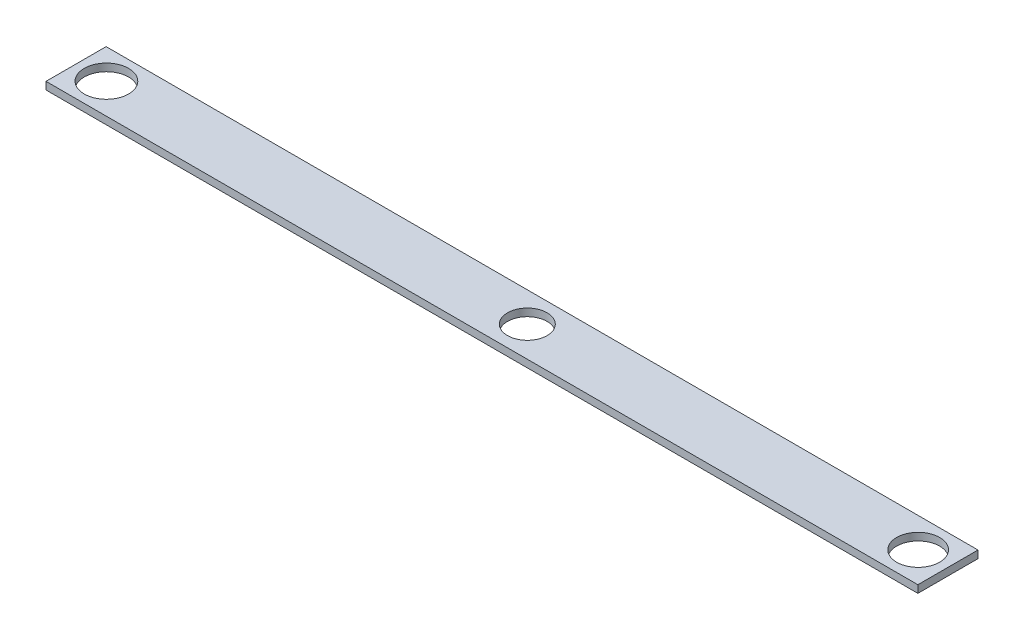
ISO-10303-21;
HEADER;
FILE_DESCRIPTION(('STEP AP214'),'2;1');
FILE_NAME('part.step','',(''),(''),'','','');
FILE_SCHEMA(('AUTOMOTIVE_DESIGN { 1 0 10303 214 1 1 1 1 }'));
ENDSEC;
DATA;
#1=APPLICATION_CONTEXT('core data for automotive mechanical design processes');
#2=APPLICATION_PROTOCOL_DEFINITION('international standard','automotive_design',2000,#1);
#3=PRODUCT_CONTEXT('',#1,'mechanical');
#4=PRODUCT('Part','Part','',(#3));
#5=PRODUCT_RELATED_PRODUCT_CATEGORY('part','',(#4));
#6=PRODUCT_DEFINITION_FORMATION('','',#4);
#7=PRODUCT_DEFINITION_CONTEXT('part definition',#1,'design');
#8=PRODUCT_DEFINITION('design','',#6,#7);
#9=PRODUCT_DEFINITION_SHAPE('','',#8);
#10=(LENGTH_UNIT() NAMED_UNIT(*) SI_UNIT(.MILLI.,.METRE.));
#11=(NAMED_UNIT(*) PLANE_ANGLE_UNIT() SI_UNIT($,.RADIAN.));
#12=(NAMED_UNIT(*) SI_UNIT($,.STERADIAN.) SOLID_ANGLE_UNIT());
#13=UNCERTAINTY_MEASURE_WITH_UNIT(LENGTH_MEASURE(1.E-05),#10,'distance_accuracy_value','');
#14=(GEOMETRIC_REPRESENTATION_CONTEXT(3) GLOBAL_UNCERTAINTY_ASSIGNED_CONTEXT((#13)) GLOBAL_UNIT_ASSIGNED_CONTEXT((#10,
#11,#12)) REPRESENTATION_CONTEXT('',''));
#15=CARTESIAN_POINT('',(0.,0.,0.));
#16=DIRECTION('',(0.,0.,1.));
#17=DIRECTION('',(1.,0.,0.));
#18=AXIS2_PLACEMENT_3D('',#15,#16,#17);
#19=CARTESIAN_POINT('',(0.,1.5875,0.));
#20=DIRECTION('',(0.,1.,0.));
#21=DIRECTION('',(0.,0.,1.));
#22=AXIS2_PLACEMENT_3D('',#19,#20,#21);
#23=PLANE('',#22);
#24=CARTESIAN_POINT('',(82.55,1.5875,0.));
#25=DIRECTION('',(0.,1.,0.));
#26=DIRECTION('',(0.,0.,1.));
#27=AXIS2_PLACEMENT_3D('',#24,#25,#26);
#28=CIRCLE('',#27,4.53645458256787);
#29=CARTESIAN_POINT('',(82.55,1.5875,4.53645458256787));
#30=VERTEX_POINT('',#29);
#31=EDGE_CURVE('E117',#30,#30,#28,.T.);
#32=ORIENTED_EDGE('',*,*,#31,.F.);
#33=EDGE_LOOP('',(#32));
#34=FACE_BOUND('',#33,.T.);
#35=DIRECTION('',(0.,0.,1.));
#36=VECTOR('',#35,1.);
#37=CARTESIAN_POINT('',(-95.25,1.5875,-6.29065420560748));
#38=LINE('',#37,#36);
#39=CARTESIAN_POINT('',(-95.25,1.5875,-6.29065420560748));
#40=VERTEX_POINT('',#39);
#41=CARTESIAN_POINT('',(-95.25,1.5875,6.40934579439252));
#42=VERTEX_POINT('',#41);
#43=EDGE_CURVE('E87',#40,#42,#38,.T.);
#44=ORIENTED_EDGE('',*,*,#43,.T.);
#45=DIRECTION('',(1.,0.,0.));
#46=VECTOR('',#45,1.);
#47=CARTESIAN_POINT('',(-95.25,1.5875,6.40934579439252));
#48=LINE('',#47,#46);
#49=CARTESIAN_POINT('',(88.9,1.5875,6.40934579439252));
#50=VERTEX_POINT('',#49);
#51=EDGE_CURVE('E82',#42,#50,#48,.T.);
#52=ORIENTED_EDGE('',*,*,#51,.T.);
#53=DIRECTION('',(0.,0.,-1.));
#54=VECTOR('',#53,1.);
#55=CARTESIAN_POINT('',(88.9,1.5875,-6.29065420560748));
#56=LINE('',#55,#54);
#57=CARTESIAN_POINT('',(88.9,1.5875,-6.29065420560748));
#58=VERTEX_POINT('',#57);
#59=EDGE_CURVE('E85',#50,#58,#56,.T.);
#60=ORIENTED_EDGE('',*,*,#59,.T.);
#61=DIRECTION('',(-1.,0.,0.));
#62=VECTOR('',#61,1.);
#63=CARTESIAN_POINT('',(-95.25,1.5875,-6.29065420560748));
#64=LINE('',#63,#62);
#65=EDGE_CURVE('E52',#58,#40,#64,.T.);
#66=ORIENTED_EDGE('',*,*,#65,.T.);
#67=EDGE_LOOP('',(#44,#52,#60,#66));
#68=FACE_BOUND('',#67,.T.);
#69=CARTESIAN_POINT('',(0.,1.5875,0.));
#70=DIRECTION('',(0.,1.,0.));
#71=DIRECTION('',(0.,0.,1.));
#72=AXIS2_PLACEMENT_3D('',#69,#70,#71);
#73=CIRCLE('',#72,4.18118096856415);
#74=CARTESIAN_POINT('',(0.,1.5875,4.18118096856415));
#75=VERTEX_POINT('',#74);
#76=EDGE_CURVE('E102',#75,#75,#73,.T.);
#77=ORIENTED_EDGE('',*,*,#76,.F.);
#78=EDGE_LOOP('',(#77));
#79=FACE_BOUND('',#78,.T.);
#80=CARTESIAN_POINT('',(-88.9,1.5875,0.));
#81=DIRECTION('',(0.,1.,0.));
#82=DIRECTION('',(0.,0.,1.));
#83=AXIS2_PLACEMENT_3D('',#80,#81,#82);
#84=CIRCLE('',#83,4.68878801733777);
#85=CARTESIAN_POINT('',(-88.9,1.5875,4.68878801733777));
#86=VERTEX_POINT('',#85);
#87=EDGE_CURVE('E123',#86,#86,#84,.T.);
#88=ORIENTED_EDGE('',*,*,#87,.F.);
#89=EDGE_LOOP('',(#88));
#90=FACE_BOUND('',#89,.T.);
#91=ADVANCED_FACE('F35',(#34,#68,#79,#90),#23,.T.);
#92=CARTESIAN_POINT('',(0.,0.,0.));
#93=DIRECTION('',(0.,1.,0.));
#94=DIRECTION('',(0.,0.,1.));
#95=AXIS2_PLACEMENT_3D('',#92,#93,#94);
#96=PLANE('',#95);
#97=DIRECTION('',(0.,0.,1.));
#98=VECTOR('',#97,1.);
#99=CARTESIAN_POINT('',(-95.25,0.,-6.29065420560748));
#100=LINE('',#99,#98);
#101=CARTESIAN_POINT('',(-95.25,0.,-6.29065420560748));
#102=VERTEX_POINT('',#101);
#103=CARTESIAN_POINT('',(-95.25,0.,6.40934579439252));
#104=VERTEX_POINT('',#103);
#105=EDGE_CURVE('E99',#102,#104,#100,.T.);
#106=ORIENTED_EDGE('',*,*,#105,.F.);
#107=DIRECTION('',(-1.,0.,0.));
#108=VECTOR('',#107,1.);
#109=CARTESIAN_POINT('',(-95.25,0.,-6.29065420560748));
#110=LINE('',#109,#108);
#111=CARTESIAN_POINT('',(88.9,0.,-6.29065420560748));
#112=VERTEX_POINT('',#111);
#113=EDGE_CURVE('E75',#112,#102,#110,.T.);
#114=ORIENTED_EDGE('',*,*,#113,.F.);
#115=DIRECTION('',(0.,0.,-1.));
#116=VECTOR('',#115,1.);
#117=CARTESIAN_POINT('',(88.9,0.,-6.29065420560748));
#118=LINE('',#117,#116);
#119=CARTESIAN_POINT('',(88.9,0.,6.40934579439252));
#120=VERTEX_POINT('',#119);
#121=EDGE_CURVE('E69',#120,#112,#118,.T.);
#122=ORIENTED_EDGE('',*,*,#121,.F.);
#123=DIRECTION('',(1.,0.,0.));
#124=VECTOR('',#123,1.);
#125=CARTESIAN_POINT('',(-95.25,0.,6.40934579439252));
#126=LINE('',#125,#124);
#127=EDGE_CURVE('E91',#104,#120,#126,.T.);
#128=ORIENTED_EDGE('',*,*,#127,.F.);
#129=EDGE_LOOP('',(#106,#114,#122,#128));
#130=FACE_BOUND('',#129,.T.);
#131=CARTESIAN_POINT('',(0.,0.,0.));
#132=DIRECTION('',(0.,1.,0.));
#133=DIRECTION('',(0.,0.,1.));
#134=AXIS2_PLACEMENT_3D('',#131,#132,#133);
#135=CIRCLE('',#134,4.18118096856415);
#136=CARTESIAN_POINT('',(0.,0.,4.18118096856415));
#137=VERTEX_POINT('',#136);
#138=EDGE_CURVE('E114',#137,#137,#135,.T.);
#139=ORIENTED_EDGE('',*,*,#138,.T.);
#140=EDGE_LOOP('',(#139));
#141=FACE_BOUND('',#140,.T.);
#142=CARTESIAN_POINT('',(82.55,0.,0.));
#143=DIRECTION('',(0.,1.,0.));
#144=DIRECTION('',(0.,0.,1.));
#145=AXIS2_PLACEMENT_3D('',#142,#143,#144);
#146=CIRCLE('',#145,4.53645458256787);
#147=CARTESIAN_POINT('',(82.55,0.,4.53645458256787));
#148=VERTEX_POINT('',#147);
#149=EDGE_CURVE('E120',#148,#148,#146,.T.);
#150=ORIENTED_EDGE('',*,*,#149,.T.);
#151=EDGE_LOOP('',(#150));
#152=FACE_BOUND('',#151,.T.);
#153=CARTESIAN_POINT('',(-88.9,0.,0.));
#154=DIRECTION('',(0.,1.,0.));
#155=DIRECTION('',(0.,0.,1.));
#156=AXIS2_PLACEMENT_3D('',#153,#154,#155);
#157=CIRCLE('',#156,4.68878801733777);
#158=CARTESIAN_POINT('',(-88.9,0.,4.68878801733777));
#159=VERTEX_POINT('',#158);
#160=EDGE_CURVE('E126',#159,#159,#157,.T.);
#161=ORIENTED_EDGE('',*,*,#160,.T.);
#162=EDGE_LOOP('',(#161));
#163=FACE_BOUND('',#162,.T.);
#164=ADVANCED_FACE('F110',(#130,#141,#152,#163),#96,.F.);
#165=CARTESIAN_POINT('',(-95.25,1.5875,-6.29065420560748));
#166=DIRECTION('',(1.,0.,0.));
#167=DIRECTION('',(0.,0.,-1.));
#168=AXIS2_PLACEMENT_3D('',#165,#166,#167);
#169=PLANE('',#168);
#170=ORIENTED_EDGE('',*,*,#105,.T.);
#171=DIRECTION('',(0.,-1.,0.));
#172=VECTOR('',#171,1.);
#173=CARTESIAN_POINT('',(-95.25,1.5875,6.40934579439252));
#174=LINE('',#173,#172);
#175=EDGE_CURVE('E11',#42,#104,#174,.T.);
#176=ORIENTED_EDGE('',*,*,#175,.F.);
#177=ORIENTED_EDGE('',*,*,#43,.F.);
#178=DIRECTION('',(0.,-1.,0.));
#179=VECTOR('',#178,1.);
#180=CARTESIAN_POINT('',(-95.25,1.5875,-6.29065420560748));
#181=LINE('',#180,#179);
#182=EDGE_CURVE('E95',#40,#102,#181,.T.);
#183=ORIENTED_EDGE('',*,*,#182,.T.);
#184=EDGE_LOOP('',(#170,#176,#177,#183));
#185=FACE_BOUND('',#184,.T.);
#186=ADVANCED_FACE('F37',(#185),#169,.F.);
#187=CARTESIAN_POINT('',(-95.25,1.5875,6.40934579439252));
#188=DIRECTION('',(0.,0.,-1.));
#189=DIRECTION('',(-1.,0.,0.));
#190=AXIS2_PLACEMENT_3D('',#187,#188,#189);
#191=PLANE('',#190);
#192=ORIENTED_EDGE('',*,*,#127,.T.);
#193=DIRECTION('',(0.,-1.,0.));
#194=VECTOR('',#193,1.);
#195=CARTESIAN_POINT('',(88.9,1.5875,6.40934579439252));
#196=LINE('',#195,#194);
#197=EDGE_CURVE('E44',#50,#120,#196,.T.);
#198=ORIENTED_EDGE('',*,*,#197,.F.);
#199=ORIENTED_EDGE('',*,*,#51,.F.);
#200=ORIENTED_EDGE('',*,*,#175,.T.);
#201=EDGE_LOOP('',(#192,#198,#199,#200));
#202=FACE_BOUND('',#201,.T.);
#203=ADVANCED_FACE('F90',(#202),#191,.F.);
#204=CARTESIAN_POINT('',(88.9,1.5875,-6.29065420560748));
#205=DIRECTION('',(-1.,0.,0.));
#206=DIRECTION('',(0.,0.,1.));
#207=AXIS2_PLACEMENT_3D('',#204,#205,#206);
#208=PLANE('',#207);
#209=ORIENTED_EDGE('',*,*,#121,.T.);
#210=DIRECTION('',(0.,-1.,0.));
#211=VECTOR('',#210,1.);
#212=CARTESIAN_POINT('',(88.9,1.5875,-6.29065420560748));
#213=LINE('',#212,#211);
#214=EDGE_CURVE('E92',#58,#112,#213,.T.);
#215=ORIENTED_EDGE('',*,*,#214,.F.);
#216=ORIENTED_EDGE('',*,*,#59,.F.);
#217=ORIENTED_EDGE('',*,*,#197,.T.);
#218=EDGE_LOOP('',(#209,#215,#216,#217));
#219=FACE_BOUND('',#218,.T.);
#220=ADVANCED_FACE('F93',(#219),#208,.F.);
#221=CARTESIAN_POINT('',(-95.25,1.5875,-6.29065420560748));
#222=DIRECTION('',(0.,0.,1.));
#223=DIRECTION('',(1.,0.,0.));
#224=AXIS2_PLACEMENT_3D('',#221,#222,#223);
#225=PLANE('',#224);
#226=ORIENTED_EDGE('',*,*,#113,.T.);
#227=ORIENTED_EDGE('',*,*,#182,.F.);
#228=ORIENTED_EDGE('',*,*,#65,.F.);
#229=ORIENTED_EDGE('',*,*,#214,.T.);
#230=EDGE_LOOP('',(#226,#227,#228,#229));
#231=FACE_BOUND('',#230,.T.);
#232=ADVANCED_FACE('F107',(#231),#225,.F.);
#233=CARTESIAN_POINT('',(0.,1.5875,0.));
#234=DIRECTION('',(0.,-1.,0.));
#235=DIRECTION('',(0.,0.,-1.));
#236=AXIS2_PLACEMENT_3D('',#233,#234,#235);
#237=CYLINDRICAL_SURFACE('',#236,4.18118096856415);
#238=ORIENTED_EDGE('',*,*,#76,.T.);
#239=EDGE_LOOP('',(#238));
#240=FACE_BOUND('',#239,.T.);
#241=ORIENTED_EDGE('',*,*,#138,.F.);
#242=EDGE_LOOP('',(#241));
#243=FACE_BOUND('',#242,.T.);
#244=ADVANCED_FACE('F144',(#240,#243),#237,.F.);
#245=CARTESIAN_POINT('',(82.55,1.5875,0.));
#246=DIRECTION('',(0.,-1.,0.));
#247=DIRECTION('',(0.,0.,-1.));
#248=AXIS2_PLACEMENT_3D('',#245,#246,#247);
#249=CYLINDRICAL_SURFACE('',#248,4.53645458256787);
#250=ORIENTED_EDGE('',*,*,#31,.T.);
#251=EDGE_LOOP('',(#250));
#252=FACE_BOUND('',#251,.T.);
#253=ORIENTED_EDGE('',*,*,#149,.F.);
#254=EDGE_LOOP('',(#253));
#255=FACE_BOUND('',#254,.T.);
#256=ADVANCED_FACE('F190',(#252,#255),#249,.F.);
#257=CARTESIAN_POINT('',(-88.9,1.5875,0.));
#258=DIRECTION('',(0.,-1.,0.));
#259=DIRECTION('',(0.,0.,-1.));
#260=AXIS2_PLACEMENT_3D('',#257,#258,#259);
#261=CYLINDRICAL_SURFACE('',#260,4.68878801733777);
#262=ORIENTED_EDGE('',*,*,#87,.T.);
#263=EDGE_LOOP('',(#262));
#264=FACE_BOUND('',#263,.T.);
#265=ORIENTED_EDGE('',*,*,#160,.F.);
#266=EDGE_LOOP('',(#265));
#267=FACE_BOUND('',#266,.T.);
#268=ADVANCED_FACE('F132',(#264,#267),#261,.F.);
#269=CLOSED_SHELL('',(#91,#164,#186,#203,#220,#232,#244,#256,#268));
#270=MANIFOLD_SOLID_BREP('B2',#269);
#271=ADVANCED_BREP_SHAPE_REPRESENTATION('',(#18,#270),#14);
#272=SHAPE_DEFINITION_REPRESENTATION(#9,#271);
ENDSEC;
END-ISO-10303-21;
